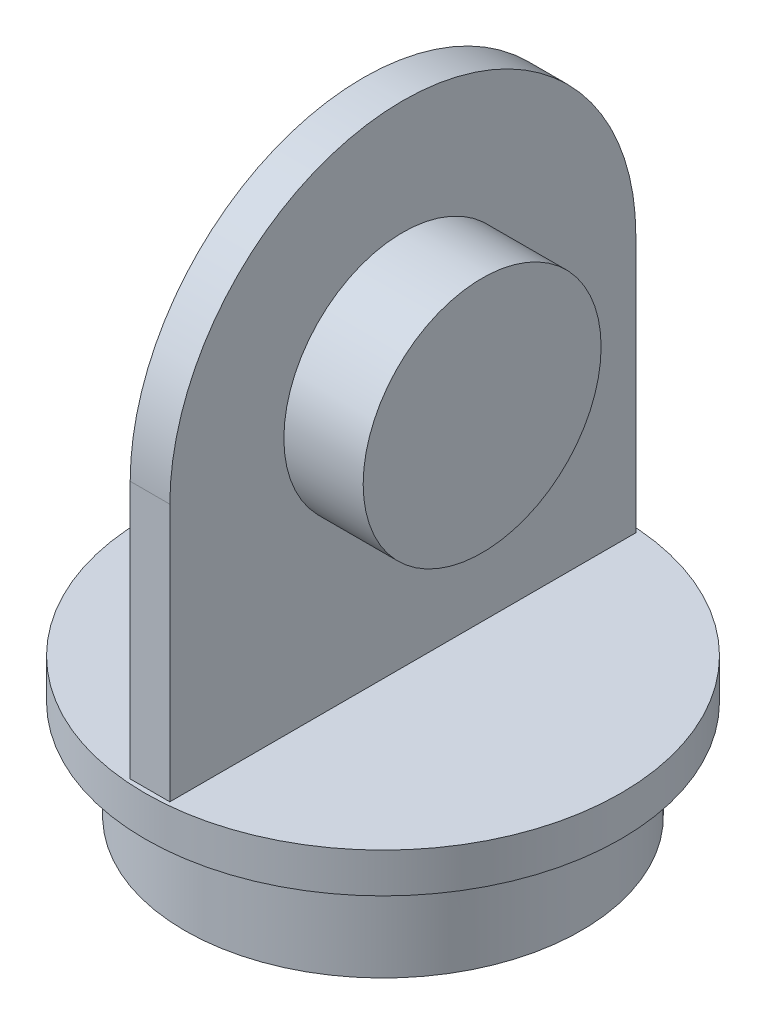
ISO-10303-21;
HEADER;
FILE_DESCRIPTION(('STEP AP214'),'2;1');
FILE_NAME('part.step','',(''),(''),'','','');
FILE_SCHEMA(('AUTOMOTIVE_DESIGN { 1 0 10303 214 1 1 1 1 }'));
ENDSEC;
DATA;
#1=APPLICATION_CONTEXT('core data for automotive mechanical design processes');
#2=APPLICATION_PROTOCOL_DEFINITION('international standard','automotive_design',2000,#1);
#3=PRODUCT_CONTEXT('',#1,'mechanical');
#4=PRODUCT('Part','Part','',(#3));
#5=PRODUCT_RELATED_PRODUCT_CATEGORY('part','',(#4));
#6=PRODUCT_DEFINITION_FORMATION('','',#4);
#7=PRODUCT_DEFINITION_CONTEXT('part definition',#1,'design');
#8=PRODUCT_DEFINITION('design','',#6,#7);
#9=PRODUCT_DEFINITION_SHAPE('','',#8);
#10=(LENGTH_UNIT() NAMED_UNIT(*) SI_UNIT(.MILLI.,.METRE.));
#11=(NAMED_UNIT(*) PLANE_ANGLE_UNIT() SI_UNIT($,.RADIAN.));
#12=(NAMED_UNIT(*) SI_UNIT($,.STERADIAN.) SOLID_ANGLE_UNIT());
#13=UNCERTAINTY_MEASURE_WITH_UNIT(LENGTH_MEASURE(1.E-05),#10,'distance_accuracy_value','');
#14=(GEOMETRIC_REPRESENTATION_CONTEXT(3) GLOBAL_UNCERTAINTY_ASSIGNED_CONTEXT((#13)) GLOBAL_UNIT_ASSIGNED_CONTEXT((#10,
#11,#12)) REPRESENTATION_CONTEXT('',''));
#15=CARTESIAN_POINT('',(0.,0.,0.));
#16=DIRECTION('',(0.,0.,1.));
#17=DIRECTION('',(1.,0.,0.));
#18=AXIS2_PLACEMENT_3D('',#15,#16,#17);
#19=CARTESIAN_POINT('',(2.,24.483278246138,0.));
#20=DIRECTION('',(-1.,0.,0.));
#21=DIRECTION('',(0.,0.,1.));
#22=AXIS2_PLACEMENT_3D('',#19,#20,#21);
#23=PLANE('',#22);
#24=DIRECTION('',(0.,0.,-1.));
#25=VECTOR('',#24,1.);
#26=CARTESIAN_POINT('',(2.,-1.51672175386197,23.5));
#27=LINE('',#26,#25);
#28=CARTESIAN_POINT('',(2.,-1.51672175386197,23.5));
#29=VERTEX_POINT('',#28);
#30=CARTESIAN_POINT('',(2.,-1.51672175386197,-23.5));
#31=VERTEX_POINT('',#30);
#32=EDGE_CURVE('E58',#29,#31,#27,.T.);
#33=ORIENTED_EDGE('',*,*,#32,.T.);
#34=DIRECTION('',(0.,1.,0.));
#35=VECTOR('',#34,1.);
#36=CARTESIAN_POINT('',(2.,24.483278246138,-23.5));
#37=LINE('',#36,#35);
#38=CARTESIAN_POINT('',(2.,24.483278246138,-23.5));
#39=VERTEX_POINT('',#38);
#40=EDGE_CURVE('E76',#31,#39,#37,.T.);
#41=ORIENTED_EDGE('',*,*,#40,.T.);
#42=CARTESIAN_POINT('',(2.,24.483278246138,0.));
#43=DIRECTION('',(1.,0.,0.));
#44=DIRECTION('',(0.,0.,1.));
#45=AXIS2_PLACEMENT_3D('',#42,#43,#44);
#46=CIRCLE('',#45,23.5);
#47=CARTESIAN_POINT('',(2.,24.483278246138,23.5));
#48=VERTEX_POINT('',#47);
#49=EDGE_CURVE('E80',#39,#48,#46,.T.);
#50=ORIENTED_EDGE('',*,*,#49,.T.);
#51=DIRECTION('',(0.,-1.,0.));
#52=VECTOR('',#51,1.);
#53=CARTESIAN_POINT('',(2.,-1.51672175386197,23.5));
#54=LINE('',#53,#52);
#55=EDGE_CURVE('E96',#48,#29,#54,.T.);
#56=ORIENTED_EDGE('',*,*,#55,.T.);
#57=EDGE_LOOP('',(#33,#41,#50,#56));
#58=FACE_BOUND('',#57,.T.);
#59=CARTESIAN_POINT('',(2.,24.483278246138,0.));
#60=DIRECTION('',(-1.,0.,0.));
#61=DIRECTION('',(0.,0.,1.));
#62=AXIS2_PLACEMENT_3D('',#59,#60,#61);
#63=CIRCLE('',#62,12.);
#64=CARTESIAN_POINT('',(2.,24.483278246138,12.));
#65=VERTEX_POINT('',#64);
#66=EDGE_CURVE('E11',#65,#65,#63,.F.);
#67=ORIENTED_EDGE('',*,*,#66,.F.);
#68=EDGE_LOOP('',(#67));
#69=FACE_BOUND('',#68,.T.);
#70=ADVANCED_FACE('F36',(#58,#69),#23,.F.);
#71=CARTESIAN_POINT('',(-2.,24.483278246138,0.));
#72=DIRECTION('',(-1.,0.,0.));
#73=DIRECTION('',(0.,0.,1.));
#74=AXIS2_PLACEMENT_3D('',#71,#72,#73);
#75=PLANE('',#74);
#76=DIRECTION('',(0.,0.,-1.));
#77=VECTOR('',#76,1.);
#78=CARTESIAN_POINT('',(-2.,-1.51672175386197,23.5));
#79=LINE('',#78,#77);
#80=CARTESIAN_POINT('',(-2.,-1.51672175386197,23.5));
#81=VERTEX_POINT('',#80);
#82=CARTESIAN_POINT('',(-2.,-1.51672175386197,-23.5));
#83=VERTEX_POINT('',#82);
#84=EDGE_CURVE('E102',#81,#83,#79,.T.);
#85=ORIENTED_EDGE('',*,*,#84,.F.);
#86=DIRECTION('',(0.,-1.,0.));
#87=VECTOR('',#86,1.);
#88=CARTESIAN_POINT('',(-2.,-1.51672175386197,23.5));
#89=LINE('',#88,#87);
#90=CARTESIAN_POINT('',(-2.,24.483278246138,23.5));
#91=VERTEX_POINT('',#90);
#92=EDGE_CURVE('E108',#91,#81,#89,.T.);
#93=ORIENTED_EDGE('',*,*,#92,.F.);
#94=CARTESIAN_POINT('',(-2.,24.483278246138,0.));
#95=DIRECTION('',(1.,0.,0.));
#96=DIRECTION('',(0.,0.,1.));
#97=AXIS2_PLACEMENT_3D('',#94,#95,#96);
#98=CIRCLE('',#97,23.5);
#99=CARTESIAN_POINT('',(-2.,24.483278246138,-23.5));
#100=VERTEX_POINT('',#99);
#101=EDGE_CURVE('E106',#100,#91,#98,.T.);
#102=ORIENTED_EDGE('',*,*,#101,.F.);
#103=DIRECTION('',(0.,1.,0.));
#104=VECTOR('',#103,1.);
#105=CARTESIAN_POINT('',(-2.,24.483278246138,-23.5));
#106=LINE('',#105,#104);
#107=EDGE_CURVE('E88',#83,#100,#106,.T.);
#108=ORIENTED_EDGE('',*,*,#107,.F.);
#109=EDGE_LOOP('',(#85,#93,#102,#108));
#110=FACE_BOUND('',#109,.T.);
#111=CARTESIAN_POINT('',(-2.,24.483278246138,0.));
#112=DIRECTION('',(-1.,0.,0.));
#113=DIRECTION('',(0.,0.,1.));
#114=AXIS2_PLACEMENT_3D('',#111,#112,#113);
#115=CIRCLE('',#114,12.);
#116=CARTESIAN_POINT('',(-2.,24.483278246138,12.));
#117=VERTEX_POINT('',#116);
#118=EDGE_CURVE('E40',#117,#117,#115,.F.);
#119=ORIENTED_EDGE('',*,*,#118,.T.);
#120=EDGE_LOOP('',(#119));
#121=FACE_BOUND('',#120,.T.);
#122=ADVANCED_FACE('F127',(#110,#121),#75,.T.);
#123=CARTESIAN_POINT('',(0.,-5.51672175386197,0.));
#124=DIRECTION('',(0.,1.,0.));
#125=DIRECTION('',(0.,0.,1.));
#126=AXIS2_PLACEMENT_3D('',#123,#124,#125);
#127=PLANE('',#126);
#128=CARTESIAN_POINT('',(0.,-5.51672175386197,0.));
#129=DIRECTION('',(0.,1.,0.));
#130=DIRECTION('',(0.,0.,1.));
#131=AXIS2_PLACEMENT_3D('',#128,#129,#130);
#132=CIRCLE('',#131,24.);
#133=CARTESIAN_POINT('',(0.,-5.51672175386197,24.));
#134=VERTEX_POINT('',#133);
#135=EDGE_CURVE('E114',#134,#134,#132,.T.);
#136=ORIENTED_EDGE('',*,*,#135,.F.);
#137=EDGE_LOOP('',(#136));
#138=FACE_BOUND('',#137,.T.);
#139=CARTESIAN_POINT('',(0.,-5.51672175386197,0.));
#140=DIRECTION('',(0.,1.,0.));
#141=DIRECTION('',(0.,0.,1.));
#142=AXIS2_PLACEMENT_3D('',#139,#140,#141);
#143=CIRCLE('',#142,20.);
#144=CARTESIAN_POINT('',(0.,-5.51672175386197,20.));
#145=VERTEX_POINT('',#144);
#146=EDGE_CURVE('E45',#145,#145,#143,.F.);
#147=ORIENTED_EDGE('',*,*,#146,.F.);
#148=EDGE_LOOP('',(#147));
#149=FACE_BOUND('',#148,.T.);
#150=ADVANCED_FACE('F124',(#138,#149),#127,.F.);
#151=CARTESIAN_POINT('',(0.,-1.51672175386197,0.));
#152=DIRECTION('',(0.,1.,0.));
#153=DIRECTION('',(0.,0.,1.));
#154=AXIS2_PLACEMENT_3D('',#151,#152,#153);
#155=PLANE('',#154);
#156=CARTESIAN_POINT('',(0.,-1.51672175386197,0.));
#157=DIRECTION('',(0.,1.,0.));
#158=DIRECTION('',(0.,0.,1.));
#159=AXIS2_PLACEMENT_3D('',#156,#157,#158);
#160=CIRCLE('',#159,24.);
#161=CARTESIAN_POINT('',(0.,-1.51672175386197,24.));
#162=VERTEX_POINT('',#161);
#163=EDGE_CURVE('E115',#162,#162,#160,.T.);
#164=ORIENTED_EDGE('',*,*,#163,.T.);
#165=EDGE_LOOP('',(#164));
#166=FACE_BOUND('',#165,.T.);
#167=DIRECTION('',(-1.,0.,0.));
#168=VECTOR('',#167,1.);
#169=CARTESIAN_POINT('',(2.,-1.51672175386197,-23.5));
#170=LINE('',#169,#168);
#171=EDGE_CURVE('E53',#31,#83,#170,.T.);
#172=ORIENTED_EDGE('',*,*,#171,.F.);
#173=ORIENTED_EDGE('',*,*,#32,.F.);
#174=DIRECTION('',(-1.,0.,0.));
#175=VECTOR('',#174,1.);
#176=CARTESIAN_POINT('',(2.,-1.51672175386197,23.5));
#177=LINE('',#176,#175);
#178=EDGE_CURVE('E98',#29,#81,#177,.T.);
#179=ORIENTED_EDGE('',*,*,#178,.T.);
#180=ORIENTED_EDGE('',*,*,#84,.T.);
#181=EDGE_LOOP('',(#172,#173,#179,#180));
#182=FACE_BOUND('',#181,.T.);
#183=ADVANCED_FACE('F126',(#166,#182),#155,.T.);
#184=CARTESIAN_POINT('',(0.,-1.51672175386197,0.));
#185=DIRECTION('',(0.,-1.,0.));
#186=DIRECTION('',(0.,0.,-1.));
#187=AXIS2_PLACEMENT_3D('',#184,#185,#186);
#188=CYLINDRICAL_SURFACE('',#187,24.);
#189=ORIENTED_EDGE('',*,*,#163,.F.);
#190=EDGE_LOOP('',(#189));
#191=FACE_BOUND('',#190,.T.);
#192=ORIENTED_EDGE('',*,*,#135,.T.);
#193=EDGE_LOOP('',(#192));
#194=FACE_BOUND('',#193,.T.);
#195=ADVANCED_FACE('F38',(#191,#194),#188,.T.);
#196=CARTESIAN_POINT('',(2.,24.483278246138,-23.5));
#197=DIRECTION('',(0.,0.,1.));
#198=DIRECTION('',(0.,-1.,0.));
#199=AXIS2_PLACEMENT_3D('',#196,#197,#198);
#200=PLANE('',#199);
#201=ORIENTED_EDGE('',*,*,#107,.T.);
#202=DIRECTION('',(-1.,0.,0.));
#203=VECTOR('',#202,1.);
#204=CARTESIAN_POINT('',(2.,24.483278246138,-23.5));
#205=LINE('',#204,#203);
#206=EDGE_CURVE('E85',#39,#100,#205,.T.);
#207=ORIENTED_EDGE('',*,*,#206,.F.);
#208=ORIENTED_EDGE('',*,*,#40,.F.);
#209=ORIENTED_EDGE('',*,*,#171,.T.);
#210=EDGE_LOOP('',(#201,#207,#208,#209));
#211=FACE_BOUND('',#210,.T.);
#212=ADVANCED_FACE('F86',(#211),#200,.F.);
#213=CARTESIAN_POINT('',(2.,24.483278246138,0.));
#214=DIRECTION('',(-1.,0.,0.));
#215=DIRECTION('',(0.,0.,1.));
#216=AXIS2_PLACEMENT_3D('',#213,#214,#215);
#217=CYLINDRICAL_SURFACE('',#216,23.5);
#218=ORIENTED_EDGE('',*,*,#101,.T.);
#219=DIRECTION('',(-1.,0.,0.));
#220=VECTOR('',#219,1.);
#221=CARTESIAN_POINT('',(2.,24.483278246138,23.5));
#222=LINE('',#221,#220);
#223=EDGE_CURVE('E91',#48,#91,#222,.T.);
#224=ORIENTED_EDGE('',*,*,#223,.F.);
#225=ORIENTED_EDGE('',*,*,#49,.F.);
#226=ORIENTED_EDGE('',*,*,#206,.T.);
#227=EDGE_LOOP('',(#218,#224,#225,#226));
#228=FACE_BOUND('',#227,.T.);
#229=ADVANCED_FACE('F93',(#228),#217,.T.);
#230=CARTESIAN_POINT('',(2.,-1.51672175386197,23.5));
#231=DIRECTION('',(0.,0.,-1.));
#232=DIRECTION('',(0.,1.,0.));
#233=AXIS2_PLACEMENT_3D('',#230,#231,#232);
#234=PLANE('',#233);
#235=ORIENTED_EDGE('',*,*,#92,.T.);
#236=ORIENTED_EDGE('',*,*,#178,.F.);
#237=ORIENTED_EDGE('',*,*,#55,.F.);
#238=ORIENTED_EDGE('',*,*,#223,.T.);
#239=EDGE_LOOP('',(#235,#236,#237,#238));
#240=FACE_BOUND('',#239,.T.);
#241=ADVANCED_FACE('F145',(#240),#234,.F.);
#242=CARTESIAN_POINT('',(0.,-15.516721753862,0.));
#243=DIRECTION('',(0.,1.,0.));
#244=DIRECTION('',(0.,0.,1.));
#245=AXIS2_PLACEMENT_3D('',#242,#243,#244);
#246=CYLINDRICAL_SURFACE('',#245,20.);
#247=CARTESIAN_POINT('',(0.,-15.516721753862,0.));
#248=DIRECTION('',(0.,-1.,0.));
#249=DIRECTION('',(0.,0.,-1.));
#250=AXIS2_PLACEMENT_3D('',#247,#248,#249);
#251=CIRCLE('',#250,20.);
#252=CARTESIAN_POINT('',(0.,-15.516721753862,-20.));
#253=VERTEX_POINT('',#252);
#254=EDGE_CURVE('E104',#253,#253,#251,.T.);
#255=ORIENTED_EDGE('',*,*,#254,.F.);
#256=EDGE_LOOP('',(#255));
#257=FACE_BOUND('',#256,.T.);
#258=ORIENTED_EDGE('',*,*,#146,.T.);
#259=EDGE_LOOP('',(#258));
#260=FACE_BOUND('',#259,.T.);
#261=ADVANCED_FACE('F122',(#257,#260),#246,.T.);
#262=CARTESIAN_POINT('',(0.,-15.516721753862,0.));
#263=DIRECTION('',(0.,-1.,0.));
#264=DIRECTION('',(0.,0.,-1.));
#265=AXIS2_PLACEMENT_3D('',#262,#263,#264);
#266=PLANE('',#265);
#267=ORIENTED_EDGE('',*,*,#254,.T.);
#268=EDGE_LOOP('',(#267));
#269=FACE_BOUND('',#268,.T.);
#270=ADVANCED_FACE('F204',(#269),#266,.T.);
#271=CARTESIAN_POINT('',(-10.,24.483278246138,0.));
#272=DIRECTION('',(1.,0.,0.));
#273=DIRECTION('',(0.,0.,-1.));
#274=AXIS2_PLACEMENT_3D('',#271,#272,#273);
#275=PLANE('',#274);
#276=CARTESIAN_POINT('',(-10.,24.483278246138,0.));
#277=DIRECTION('',(1.,0.,0.));
#278=DIRECTION('',(0.,0.,-1.));
#279=AXIS2_PLACEMENT_3D('',#276,#277,#278);
#280=CIRCLE('',#279,12.);
#281=CARTESIAN_POINT('',(-10.,24.483278246138,-12.));
#282=VERTEX_POINT('',#281);
#283=EDGE_CURVE('E259',#282,#282,#280,.T.);
#284=ORIENTED_EDGE('',*,*,#283,.F.);
#285=EDGE_LOOP('',(#284));
#286=FACE_BOUND('',#285,.T.);
#287=ADVANCED_FACE('F212',(#286),#275,.F.);
#288=CARTESIAN_POINT('',(10.,24.483278246138,0.));
#289=DIRECTION('',(-1.,0.,0.));
#290=DIRECTION('',(0.,0.,1.));
#291=AXIS2_PLACEMENT_3D('',#288,#289,#290);
#292=CYLINDRICAL_SURFACE('',#291,12.);
#293=ORIENTED_EDGE('',*,*,#118,.F.);
#294=EDGE_LOOP('',(#293));
#295=FACE_BOUND('',#294,.T.);
#296=ORIENTED_EDGE('',*,*,#283,.T.);
#297=EDGE_LOOP('',(#296));
#298=FACE_BOUND('',#297,.T.);
#299=ADVANCED_FACE('F220',(#295,#298),#292,.T.);
#300=CARTESIAN_POINT('',(10.,24.483278246138,0.));
#301=DIRECTION('',(1.,0.,0.));
#302=DIRECTION('',(0.,0.,-1.));
#303=AXIS2_PLACEMENT_3D('',#300,#301,#302);
#304=CIRCLE('',#303,12.);
#305=CARTESIAN_POINT('',(10.,24.483278246138,-12.));
#306=VERTEX_POINT('',#305);
#307=EDGE_CURVE('E258',#306,#306,#304,.T.);
#308=ORIENTED_EDGE('',*,*,#307,.F.);
#309=EDGE_LOOP('',(#308));
#310=FACE_BOUND('',#309,.T.);
#311=ORIENTED_EDGE('',*,*,#66,.T.);
#312=EDGE_LOOP('',(#311));
#313=FACE_BOUND('',#312,.T.);
#314=ADVANCED_FACE('F229',(#310,#313),#292,.T.);
#315=CARTESIAN_POINT('',(10.,24.483278246138,0.));
#316=DIRECTION('',(1.,0.,0.));
#317=DIRECTION('',(0.,0.,-1.));
#318=AXIS2_PLACEMENT_3D('',#315,#316,#317);
#319=PLANE('',#318);
#320=ORIENTED_EDGE('',*,*,#307,.T.);
#321=EDGE_LOOP('',(#320));
#322=FACE_BOUND('',#321,.T.);
#323=ADVANCED_FACE('F238',(#322),#319,.T.);
#324=CLOSED_SHELL('',(#70,#122,#150,#183,#195,#212,#229,#241,#261,#270,#287,#299,#314,#323));
#325=MANIFOLD_SOLID_BREP('B2',#324);
#326=ADVANCED_BREP_SHAPE_REPRESENTATION('',(#18,#325),#14);
#327=SHAPE_DEFINITION_REPRESENTATION(#9,#326);
ENDSEC;
END-ISO-10303-21;
